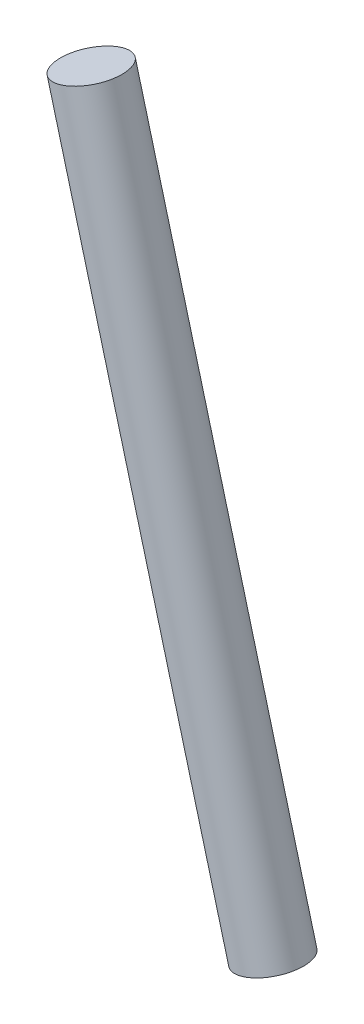
ISO-10303-21;
HEADER;
FILE_DESCRIPTION(('STEP AP214'),'2;1');
FILE_NAME('part.step','',(''),(''),'','','');
FILE_SCHEMA(('AUTOMOTIVE_DESIGN { 1 0 10303 214 1 1 1 1 }'));
ENDSEC;
DATA;
#1=APPLICATION_CONTEXT('core data for automotive mechanical design processes');
#2=APPLICATION_PROTOCOL_DEFINITION('international standard','automotive_design',2000,#1);
#3=PRODUCT_CONTEXT('',#1,'mechanical');
#4=PRODUCT('Part','Part','',(#3));
#5=PRODUCT_RELATED_PRODUCT_CATEGORY('part','',(#4));
#6=PRODUCT_DEFINITION_FORMATION('','',#4);
#7=PRODUCT_DEFINITION_CONTEXT('part definition',#1,'design');
#8=PRODUCT_DEFINITION('design','',#6,#7);
#9=PRODUCT_DEFINITION_SHAPE('','',#8);
#10=(LENGTH_UNIT() NAMED_UNIT(*) SI_UNIT(.MILLI.,.METRE.));
#11=(NAMED_UNIT(*) PLANE_ANGLE_UNIT() SI_UNIT($,.RADIAN.));
#12=(NAMED_UNIT(*) SI_UNIT($,.STERADIAN.) SOLID_ANGLE_UNIT());
#13=UNCERTAINTY_MEASURE_WITH_UNIT(LENGTH_MEASURE(1.E-05),#10,'distance_accuracy_value','');
#14=(GEOMETRIC_REPRESENTATION_CONTEXT(3) GLOBAL_UNCERTAINTY_ASSIGNED_CONTEXT((#13)) GLOBAL_UNIT_ASSIGNED_CONTEXT((#10,
#11,#12)) REPRESENTATION_CONTEXT('',''));
#15=CARTESIAN_POINT('',(0.,0.,0.));
#16=DIRECTION('',(0.,0.,1.));
#17=DIRECTION('',(1.,0.,0.));
#18=AXIS2_PLACEMENT_3D('',#15,#16,#17);
#19=CARTESIAN_POINT('',(-96.0714732187625,493.063669757388,175.582551715231));
#20=DIRECTION('',(0.257662650560332,-0.966234939601246,0.));
#21=DIRECTION('',(0.966234939601246,0.257662650560332,0.));
#22=AXIS2_PLACEMENT_3D('',#19,#20,#21);
#23=PLANE('',#22);
#24=CARTESIAN_POINT('',(-96.0714732187625,493.063669757388,175.582551715231));
#25=DIRECTION('',(0.257662650560332,-0.966234939601246,0.));
#26=DIRECTION('',(0.966234939601246,0.257662650560332,0.));
#27=AXIS2_PLACEMENT_3D('',#24,#25,#26);
#28=CIRCLE('',#27,17.78);
#29=CARTESIAN_POINT('',(-78.8918159926523,497.644911684351,175.582551715231));
#30=VERTEX_POINT('',#29);
#31=EDGE_CURVE('E48',#30,#30,#28,.T.);
#32=ORIENTED_EDGE('',*,*,#31,.F.);
#33=EDGE_LOOP('',(#32));
#34=FACE_BOUND('',#33,.T.);
#35=ADVANCED_FACE('F41',(#34),#23,.F.);
#36=CARTESIAN_POINT('',(5.52852678123751,112.063669757388,175.582551715231));
#37=DIRECTION('',(0.257662650560332,-0.966234939601246,0.));
#38=DIRECTION('',(0.966234939601246,0.257662650560332,0.));
#39=AXIS2_PLACEMENT_3D('',#36,#37,#38);
#40=PLANE('',#39);
#41=CARTESIAN_POINT('',(5.52852678123751,112.063669757388,175.582551715231));
#42=DIRECTION('',(0.257662650560332,-0.966234939601246,0.));
#43=DIRECTION('',(0.966234939601246,0.257662650560332,0.));
#44=AXIS2_PLACEMENT_3D('',#41,#42,#43);
#45=CIRCLE('',#44,17.78);
#46=CARTESIAN_POINT('',(22.7081840073477,116.644911684351,175.582551715231));
#47=VERTEX_POINT('',#46);
#48=EDGE_CURVE('E12',#47,#47,#45,.T.);
#49=ORIENTED_EDGE('',*,*,#48,.T.);
#50=EDGE_LOOP('',(#49));
#51=FACE_BOUND('',#50,.T.);
#52=ADVANCED_FACE('F55',(#51),#40,.T.);
#53=CARTESIAN_POINT('',(-96.0714732187625,493.063669757388,175.582551715231));
#54=DIRECTION('',(0.257662650560332,-0.966234939601246,0.));
#55=DIRECTION('',(0.966234939601246,0.257662650560332,0.));
#56=AXIS2_PLACEMENT_3D('',#53,#54,#55);
#57=CYLINDRICAL_SURFACE('',#56,17.78);
#58=ORIENTED_EDGE('',*,*,#48,.F.);
#59=EDGE_LOOP('',(#58));
#60=FACE_BOUND('',#59,.T.);
#61=ORIENTED_EDGE('',*,*,#31,.T.);
#62=EDGE_LOOP('',(#61));
#63=FACE_BOUND('',#62,.T.);
#64=ADVANCED_FACE('F57',(#60,#63),#57,.T.);
#65=CLOSED_SHELL('',(#35,#52,#64));
#66=MANIFOLD_SOLID_BREP('B2',#65);
#67=ADVANCED_BREP_SHAPE_REPRESENTATION('',(#18,#66),#14);
#68=SHAPE_DEFINITION_REPRESENTATION(#9,#67);
ENDSEC;
END-ISO-10303-21;
